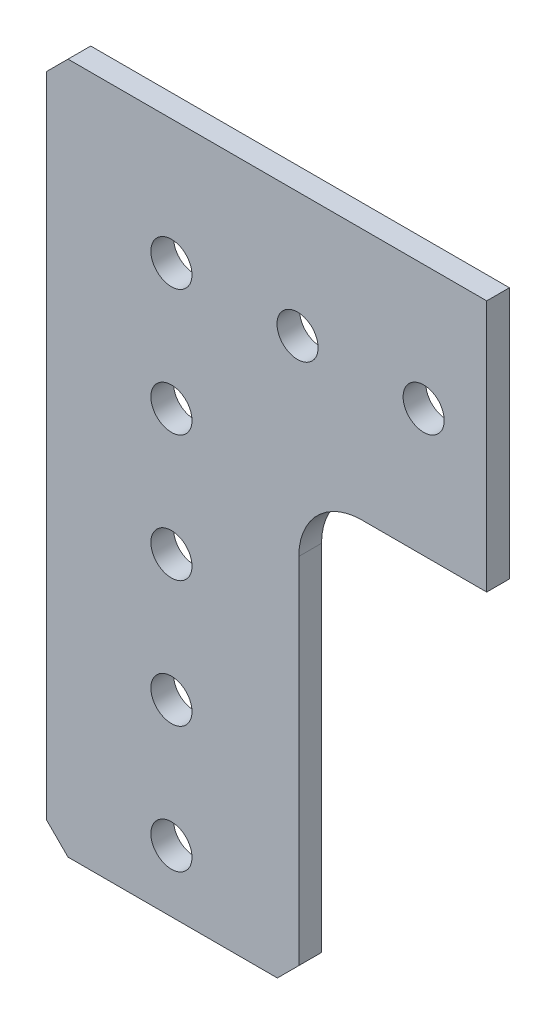
ISO-10303-21;
HEADER;
FILE_DESCRIPTION(('STEP AP214'),'2;1');
FILE_NAME('part.step','',(''),(''),'','','');
FILE_SCHEMA(('AUTOMOTIVE_DESIGN { 1 0 10303 214 1 1 1 1 }'));
ENDSEC;
DATA;
#1=APPLICATION_CONTEXT('core data for automotive mechanical design processes');
#2=APPLICATION_PROTOCOL_DEFINITION('international standard','automotive_design',2000,#1);
#3=PRODUCT_CONTEXT('',#1,'mechanical');
#4=PRODUCT('Part','Part','',(#3));
#5=PRODUCT_RELATED_PRODUCT_CATEGORY('part','',(#4));
#6=PRODUCT_DEFINITION_FORMATION('','',#4);
#7=PRODUCT_DEFINITION_CONTEXT('part definition',#1,'design');
#8=PRODUCT_DEFINITION('design','',#6,#7);
#9=PRODUCT_DEFINITION_SHAPE('','',#8);
#10=(LENGTH_UNIT() NAMED_UNIT(*) SI_UNIT(.MILLI.,.METRE.));
#11=(NAMED_UNIT(*) PLANE_ANGLE_UNIT() SI_UNIT($,.RADIAN.));
#12=(NAMED_UNIT(*) SI_UNIT($,.STERADIAN.) SOLID_ANGLE_UNIT());
#13=UNCERTAINTY_MEASURE_WITH_UNIT(LENGTH_MEASURE(1.E-05),#10,'distance_accuracy_value','');
#14=(GEOMETRIC_REPRESENTATION_CONTEXT(3) GLOBAL_UNCERTAINTY_ASSIGNED_CONTEXT((#13)) GLOBAL_UNIT_ASSIGNED_CONTEXT((#10,
#11,#12)) REPRESENTATION_CONTEXT('',''));
#15=CARTESIAN_POINT('',(0.,0.,0.));
#16=DIRECTION('',(0.,0.,1.));
#17=DIRECTION('',(1.,0.,0.));
#18=AXIS2_PLACEMENT_3D('',#15,#16,#17);
#19=CARTESIAN_POINT('',(-12.573,10.414,2.286));
#20=DIRECTION('',(-0.707106781186548,0.707106781186547,0.));
#21=DIRECTION('',(-0.707106781186547,-0.707106781186548,0.));
#22=AXIS2_PLACEMENT_3D('',#19,#20,#21);
#23=PLANE('',#22);
#24=DIRECTION('',(0.707106781186547,0.707106781186548,0.));
#25=VECTOR('',#24,1.);
#26=CARTESIAN_POINT('',(-12.573,10.414,0.));
#27=LINE('',#26,#25);
#28=CARTESIAN_POINT('',(-12.573,10.414,0.));
#29=VERTEX_POINT('',#28);
#30=CARTESIAN_POINT('',(-10.414,12.573,0.));
#31=VERTEX_POINT('',#30);
#32=EDGE_CURVE('E143',#29,#31,#27,.T.);
#33=ORIENTED_EDGE('',*,*,#32,.F.);
#34=DIRECTION('',(0.,0.,-1.));
#35=VECTOR('',#34,1.);
#36=CARTESIAN_POINT('',(-12.573,10.414,2.286));
#37=LINE('',#36,#35);
#38=CARTESIAN_POINT('',(-12.573,10.414,2.286));
#39=VERTEX_POINT('',#38);
#40=EDGE_CURVE('E11',#39,#29,#37,.T.);
#41=ORIENTED_EDGE('',*,*,#40,.F.);
#42=DIRECTION('',(0.707106781186547,0.707106781186548,0.));
#43=VECTOR('',#42,1.);
#44=CARTESIAN_POINT('',(-12.573,10.414,2.286));
#45=LINE('',#44,#43);
#46=CARTESIAN_POINT('',(-10.414,12.573,2.286));
#47=VERTEX_POINT('',#46);
#48=EDGE_CURVE('E166',#39,#47,#45,.T.);
#49=ORIENTED_EDGE('',*,*,#48,.T.);
#50=DIRECTION('',(0.,0.,-1.));
#51=VECTOR('',#50,1.);
#52=CARTESIAN_POINT('',(-10.414,12.573,2.286));
#53=LINE('',#52,#51);
#54=EDGE_CURVE('E35',#47,#31,#53,.T.);
#55=ORIENTED_EDGE('',*,*,#54,.T.);
#56=EDGE_LOOP('',(#33,#41,#49,#55));
#57=FACE_BOUND('',#56,.T.);
#58=ADVANCED_FACE('F32',(#57),#23,.T.);
#59=CARTESIAN_POINT('',(-12.573,-54.864,2.286));
#60=DIRECTION('',(-1.,0.,0.));
#61=DIRECTION('',(0.,-1.,0.));
#62=AXIS2_PLACEMENT_3D('',#59,#60,#61);
#63=PLANE('',#62);
#64=DIRECTION('',(0.,1.,0.));
#65=VECTOR('',#64,1.);
#66=CARTESIAN_POINT('',(-12.573,-54.864,0.));
#67=LINE('',#66,#65);
#68=CARTESIAN_POINT('',(-12.573,-54.864,0.));
#69=VERTEX_POINT('',#68);
#70=EDGE_CURVE('E164',#69,#29,#67,.T.);
#71=ORIENTED_EDGE('',*,*,#70,.F.);
#72=DIRECTION('',(0.,0.,-1.));
#73=VECTOR('',#72,1.);
#74=CARTESIAN_POINT('',(-12.573,-54.864,2.286));
#75=LINE('',#74,#73);
#76=CARTESIAN_POINT('',(-12.573,-54.864,2.286));
#77=VERTEX_POINT('',#76);
#78=EDGE_CURVE('E40',#77,#69,#75,.T.);
#79=ORIENTED_EDGE('',*,*,#78,.F.);
#80=DIRECTION('',(0.,1.,0.));
#81=VECTOR('',#80,1.);
#82=CARTESIAN_POINT('',(-12.573,-54.864,2.286));
#83=LINE('',#82,#81);
#84=EDGE_CURVE('E133',#77,#39,#83,.T.);
#85=ORIENTED_EDGE('',*,*,#84,.T.);
#86=ORIENTED_EDGE('',*,*,#40,.T.);
#87=EDGE_LOOP('',(#71,#79,#85,#86));
#88=FACE_BOUND('',#87,.T.);
#89=ADVANCED_FACE('F186',(#88),#63,.T.);
#90=CARTESIAN_POINT('',(-10.414,-57.023,2.286));
#91=DIRECTION('',(-0.707106781186544,-0.707106781186551,0.));
#92=DIRECTION('',(0.707106781186551,-0.707106781186544,0.));
#93=AXIS2_PLACEMENT_3D('',#90,#91,#92);
#94=PLANE('',#93);
#95=DIRECTION('',(-0.707106781186551,0.707106781186544,0.));
#96=VECTOR('',#95,1.);
#97=CARTESIAN_POINT('',(-10.414,-57.023,0.));
#98=LINE('',#97,#96);
#99=CARTESIAN_POINT('',(-10.414,-57.023,0.));
#100=VERTEX_POINT('',#99);
#101=EDGE_CURVE('E118',#100,#69,#98,.T.);
#102=ORIENTED_EDGE('',*,*,#101,.F.);
#103=DIRECTION('',(0.,0.,-1.));
#104=VECTOR('',#103,1.);
#105=CARTESIAN_POINT('',(-10.414,-57.023,2.286));
#106=LINE('',#105,#104);
#107=CARTESIAN_POINT('',(-10.414,-57.023,2.286));
#108=VERTEX_POINT('',#107);
#109=EDGE_CURVE('E112',#108,#100,#106,.T.);
#110=ORIENTED_EDGE('',*,*,#109,.F.);
#111=DIRECTION('',(-0.707106781186551,0.707106781186544,0.));
#112=VECTOR('',#111,1.);
#113=CARTESIAN_POINT('',(-10.414,-57.023,2.286));
#114=LINE('',#113,#112);
#115=EDGE_CURVE('E115',#108,#77,#114,.T.);
#116=ORIENTED_EDGE('',*,*,#115,.T.);
#117=ORIENTED_EDGE('',*,*,#78,.T.);
#118=EDGE_LOOP('',(#102,#110,#116,#117));
#119=FACE_BOUND('',#118,.T.);
#120=ADVANCED_FACE('F114',(#119),#94,.T.);
#121=CARTESIAN_POINT('',(10.668,-57.023,2.286));
#122=DIRECTION('',(0.,-1.,0.));
#123=DIRECTION('',(1.,0.,0.));
#124=AXIS2_PLACEMENT_3D('',#121,#122,#123);
#125=PLANE('',#124);
#126=DIRECTION('',(-1.,0.,0.));
#127=VECTOR('',#126,1.);
#128=CARTESIAN_POINT('',(10.668,-57.023,0.));
#129=LINE('',#128,#127);
#130=CARTESIAN_POINT('',(10.668,-57.023,0.));
#131=VERTEX_POINT('',#130);
#132=EDGE_CURVE('E161',#131,#100,#129,.T.);
#133=ORIENTED_EDGE('',*,*,#132,.F.);
#134=DIRECTION('',(0.,0.,-1.));
#135=VECTOR('',#134,1.);
#136=CARTESIAN_POINT('',(10.668,-57.023,2.286));
#137=LINE('',#136,#135);
#138=CARTESIAN_POINT('',(10.668,-57.023,2.286));
#139=VERTEX_POINT('',#138);
#140=EDGE_CURVE('E123',#139,#131,#137,.T.);
#141=ORIENTED_EDGE('',*,*,#140,.F.);
#142=DIRECTION('',(-1.,0.,0.));
#143=VECTOR('',#142,1.);
#144=CARTESIAN_POINT('',(10.668,-57.023,2.286));
#145=LINE('',#144,#143);
#146=EDGE_CURVE('E131',#139,#108,#145,.T.);
#147=ORIENTED_EDGE('',*,*,#146,.T.);
#148=ORIENTED_EDGE('',*,*,#109,.T.);
#149=EDGE_LOOP('',(#133,#141,#147,#148));
#150=FACE_BOUND('',#149,.T.);
#151=ADVANCED_FACE('F135',(#150),#125,.T.);
#152=CARTESIAN_POINT('',(12.827,-54.864,2.286));
#153=DIRECTION('',(0.707106781186548,-0.707106781186547,0.));
#154=DIRECTION('',(0.707106781186547,0.707106781186548,0.));
#155=AXIS2_PLACEMENT_3D('',#152,#153,#154);
#156=PLANE('',#155);
#157=DIRECTION('',(-0.707106781186547,-0.707106781186548,0.));
#158=VECTOR('',#157,1.);
#159=CARTESIAN_POINT('',(12.827,-54.864,0.));
#160=LINE('',#159,#158);
#161=CARTESIAN_POINT('',(12.827,-54.864,0.));
#162=VERTEX_POINT('',#161);
#163=EDGE_CURVE('E158',#162,#131,#160,.T.);
#164=ORIENTED_EDGE('',*,*,#163,.F.);
#165=DIRECTION('',(0.,0.,-1.));
#166=VECTOR('',#165,1.);
#167=CARTESIAN_POINT('',(12.827,-54.864,2.286));
#168=LINE('',#167,#166);
#169=CARTESIAN_POINT('',(12.827,-54.864,2.286));
#170=VERTEX_POINT('',#169);
#171=EDGE_CURVE('E170',#170,#162,#168,.T.);
#172=ORIENTED_EDGE('',*,*,#171,.F.);
#173=DIRECTION('',(-0.707106781186547,-0.707106781186548,0.));
#174=VECTOR('',#173,1.);
#175=CARTESIAN_POINT('',(12.827,-54.864,2.286));
#176=LINE('',#175,#174);
#177=EDGE_CURVE('E136',#170,#139,#176,.T.);
#178=ORIENTED_EDGE('',*,*,#177,.T.);
#179=ORIENTED_EDGE('',*,*,#140,.T.);
#180=EDGE_LOOP('',(#164,#172,#178,#179));
#181=FACE_BOUND('',#180,.T.);
#182=ADVANCED_FACE('F199',(#181),#156,.T.);
#183=CARTESIAN_POINT('',(12.827,-19.177,2.286));
#184=DIRECTION('',(1.,0.,0.));
#185=DIRECTION('',(0.,0.,-1.));
#186=AXIS2_PLACEMENT_3D('',#183,#184,#185);
#187=PLANE('',#186);
#188=DIRECTION('',(0.,-1.,0.));
#189=VECTOR('',#188,1.);
#190=CARTESIAN_POINT('',(12.827,-19.177,0.));
#191=LINE('',#190,#189);
#192=CARTESIAN_POINT('',(12.827,-19.177,0.));
#193=VERTEX_POINT('',#192);
#194=EDGE_CURVE('E155',#193,#162,#191,.T.);
#195=ORIENTED_EDGE('',*,*,#194,.F.);
#196=DIRECTION('',(0.,0.,-1.));
#197=VECTOR('',#196,1.);
#198=CARTESIAN_POINT('',(12.827,-19.177,2.286));
#199=LINE('',#198,#197);
#200=CARTESIAN_POINT('',(12.827,-19.177,2.286));
#201=VERTEX_POINT('',#200);
#202=EDGE_CURVE('E172',#201,#193,#199,.T.);
#203=ORIENTED_EDGE('',*,*,#202,.F.);
#204=DIRECTION('',(0.,-1.,0.));
#205=VECTOR('',#204,1.);
#206=CARTESIAN_POINT('',(12.827,-19.177,2.286));
#207=LINE('',#206,#205);
#208=EDGE_CURVE('E138',#201,#170,#207,.T.);
#209=ORIENTED_EDGE('',*,*,#208,.T.);
#210=ORIENTED_EDGE('',*,*,#171,.T.);
#211=EDGE_LOOP('',(#195,#203,#209,#210));
#212=FACE_BOUND('',#211,.T.);
#213=ADVANCED_FACE('F202',(#212),#187,.T.);
#214=CARTESIAN_POINT('',(19.177,-19.177,2.286));
#215=DIRECTION('',(0.,0.,-1.));
#216=DIRECTION('',(-1.,0.,0.));
#217=AXIS2_PLACEMENT_3D('',#214,#215,#216);
#218=CYLINDRICAL_SURFACE('',#217,6.35);
#219=CARTESIAN_POINT('',(19.177,-19.177,0.));
#220=DIRECTION('',(0.,0.,1.));
#221=DIRECTION('',(1.,0.,0.));
#222=AXIS2_PLACEMENT_3D('',#219,#220,#221);
#223=CIRCLE('',#222,6.35);
#224=CARTESIAN_POINT('',(19.177,-12.827,0.));
#225=VERTEX_POINT('',#224);
#226=EDGE_CURVE('E152',#225,#193,#223,.T.);
#227=ORIENTED_EDGE('',*,*,#226,.F.);
#228=DIRECTION('',(0.,0.,-1.));
#229=VECTOR('',#228,1.);
#230=CARTESIAN_POINT('',(19.177,-12.827,2.286));
#231=LINE('',#230,#229);
#232=CARTESIAN_POINT('',(19.177,-12.827,2.286));
#233=VERTEX_POINT('',#232);
#234=EDGE_CURVE('E173',#233,#225,#231,.T.);
#235=ORIENTED_EDGE('',*,*,#234,.F.);
#236=CARTESIAN_POINT('',(19.177,-19.177,2.286));
#237=DIRECTION('',(0.,0.,1.));
#238=DIRECTION('',(1.,0.,0.));
#239=AXIS2_PLACEMENT_3D('',#236,#237,#238);
#240=CIRCLE('',#239,6.35);
#241=EDGE_CURVE('E264',#233,#201,#240,.T.);
#242=ORIENTED_EDGE('',*,*,#241,.T.);
#243=ORIENTED_EDGE('',*,*,#202,.T.);
#244=EDGE_LOOP('',(#227,#235,#242,#243));
#245=FACE_BOUND('',#244,.T.);
#246=ADVANCED_FACE('F206',(#245),#218,.F.);
#247=CARTESIAN_POINT('',(54.864,-12.827,2.286));
#248=DIRECTION('',(0.,-1.,0.));
#249=DIRECTION('',(0.,0.,-1.));
#250=AXIS2_PLACEMENT_3D('',#247,#248,#249);
#251=PLANE('',#250);
#252=DIRECTION('',(0.,0.,1.));
#253=VECTOR('',#252,1.);
#254=CARTESIAN_POINT('',(31.75,-12.827,0.));
#255=LINE('',#254,#253);
#256=CARTESIAN_POINT('',(31.75,-12.827,0.));
#257=VERTEX_POINT('',#256);
#258=CARTESIAN_POINT('',(31.75,-12.827,2.286));
#259=VERTEX_POINT('',#258);
#260=EDGE_CURVE('E48',#257,#259,#255,.T.);
#261=ORIENTED_EDGE('',*,*,#260,.T.);
#262=DIRECTION('',(-1.,0.,0.));
#263=VECTOR('',#262,1.);
#264=CARTESIAN_POINT('',(54.864,-12.827,2.286));
#265=LINE('',#264,#263);
#266=EDGE_CURVE('E259',#259,#233,#265,.T.);
#267=ORIENTED_EDGE('',*,*,#266,.T.);
#268=ORIENTED_EDGE('',*,*,#234,.T.);
#269=DIRECTION('',(-1.,0.,0.));
#270=VECTOR('',#269,1.);
#271=CARTESIAN_POINT('',(54.864,-12.827,0.));
#272=LINE('',#271,#270);
#273=EDGE_CURVE('E150',#257,#225,#272,.T.);
#274=ORIENTED_EDGE('',*,*,#273,.F.);
#275=EDGE_LOOP('',(#261,#267,#268,#274));
#276=FACE_BOUND('',#275,.T.);
#277=ADVANCED_FACE('F210',(#276),#251,.T.);
#278=CARTESIAN_POINT('',(-10.414,12.573,2.286));
#279=DIRECTION('',(0.,1.,0.));
#280=DIRECTION('',(-1.,0.,0.));
#281=AXIS2_PLACEMENT_3D('',#278,#279,#280);
#282=PLANE('',#281);
#283=DIRECTION('',(0.,0.,1.));
#284=VECTOR('',#283,1.);
#285=CARTESIAN_POINT('',(31.75,12.573,0.));
#286=LINE('',#285,#284);
#287=CARTESIAN_POINT('',(31.75,12.573,0.));
#288=VERTEX_POINT('',#287);
#289=CARTESIAN_POINT('',(31.75,12.573,2.286));
#290=VERTEX_POINT('',#289);
#291=EDGE_CURVE('E183',#288,#290,#286,.T.);
#292=ORIENTED_EDGE('',*,*,#291,.F.);
#293=DIRECTION('',(1.,0.,0.));
#294=VECTOR('',#293,1.);
#295=CARTESIAN_POINT('',(-10.414,12.573,0.));
#296=LINE('',#295,#294);
#297=EDGE_CURVE('E146',#31,#288,#296,.T.);
#298=ORIENTED_EDGE('',*,*,#297,.F.);
#299=ORIENTED_EDGE('',*,*,#54,.F.);
#300=DIRECTION('',(1.,0.,0.));
#301=VECTOR('',#300,1.);
#302=CARTESIAN_POINT('',(-10.414,12.573,2.286));
#303=LINE('',#302,#301);
#304=EDGE_CURVE('E265',#47,#290,#303,.T.);
#305=ORIENTED_EDGE('',*,*,#304,.T.);
#306=EDGE_LOOP('',(#292,#298,#299,#305));
#307=FACE_BOUND('',#306,.T.);
#308=ADVANCED_FACE('F180',(#307),#282,.T.);
#309=CARTESIAN_POINT('',(19.177,-19.177,2.286));
#310=DIRECTION('',(0.,0.,1.));
#311=DIRECTION('',(1.,0.,0.));
#312=AXIS2_PLACEMENT_3D('',#309,#310,#311);
#313=PLANE('',#312);
#314=DIRECTION('',(0.,-1.,0.));
#315=VECTOR('',#314,1.);
#316=CARTESIAN_POINT('',(31.75,-19.177,2.286));
#317=LINE('',#316,#315);
#318=EDGE_CURVE('E254',#290,#259,#317,.T.);
#319=ORIENTED_EDGE('',*,*,#318,.F.);
#320=ORIENTED_EDGE('',*,*,#304,.F.);
#321=ORIENTED_EDGE('',*,*,#48,.F.);
#322=ORIENTED_EDGE('',*,*,#84,.F.);
#323=ORIENTED_EDGE('',*,*,#115,.F.);
#324=ORIENTED_EDGE('',*,*,#146,.F.);
#325=ORIENTED_EDGE('',*,*,#177,.F.);
#326=ORIENTED_EDGE('',*,*,#208,.F.);
#327=ORIENTED_EDGE('',*,*,#241,.F.);
#328=ORIENTED_EDGE('',*,*,#266,.F.);
#329=EDGE_LOOP('',(#319,#320,#321,#322,#323,#324,#325,#326,#327,#328));
#330=FACE_BOUND('',#329,.T.);
#331=CARTESIAN_POINT('',(3.9907631702977E-13,-38.1,2.286));
#332=DIRECTION('',(0.,0.,-1.));
#333=DIRECTION('',(1.,0.,0.));
#334=AXIS2_PLACEMENT_3D('',#331,#332,#333);
#335=CIRCLE('',#334,2.0701);
#336=CARTESIAN_POINT('',(2.0701000000004,-38.1,2.286));
#337=VERTEX_POINT('',#336);
#338=EDGE_CURVE('E277',#337,#337,#335,.T.);
#339=ORIENTED_EDGE('',*,*,#338,.T.);
#340=EDGE_LOOP('',(#339));
#341=FACE_BOUND('',#340,.T.);
#342=CARTESIAN_POINT('',(1.33025439009923E-13,-12.7,2.286));
#343=DIRECTION('',(0.,0.,-1.));
#344=DIRECTION('',(1.,0.,0.));
#345=AXIS2_PLACEMENT_3D('',#342,#343,#344);
#346=CIRCLE('',#345,2.0701);
#347=CARTESIAN_POINT('',(2.07010000000013,-12.7,2.286));
#348=VERTEX_POINT('',#347);
#349=EDGE_CURVE('E283',#348,#348,#346,.T.);
#350=ORIENTED_EDGE('',*,*,#349,.T.);
#351=EDGE_LOOP('',(#350));
#352=FACE_BOUND('',#351,.T.);
#353=CARTESIAN_POINT('',(25.4,3.54734504026462E-13,2.286));
#354=DIRECTION('',(0.,0.,-1.));
#355=DIRECTION('',(1.,0.,0.));
#356=AXIS2_PLACEMENT_3D('',#353,#354,#355);
#357=CIRCLE('',#356,2.0701);
#358=CARTESIAN_POINT('',(27.4701,3.54734504026462E-13,2.286));
#359=VERTEX_POINT('',#358);
#360=EDGE_CURVE('E289',#359,#359,#357,.T.);
#361=ORIENTED_EDGE('',*,*,#360,.T.);
#362=EDGE_LOOP('',(#361));
#363=FACE_BOUND('',#362,.T.);
#364=CARTESIAN_POINT('',(0.,0.,2.286));
#365=DIRECTION('',(0.,0.,-1.));
#366=DIRECTION('',(1.,0.,0.));
#367=AXIS2_PLACEMENT_3D('',#364,#365,#366);
#368=CIRCLE('',#367,2.0701);
#369=CARTESIAN_POINT('',(2.0701,0.,2.286));
#370=VERTEX_POINT('',#369);
#371=EDGE_CURVE('E295',#370,#370,#368,.T.);
#372=ORIENTED_EDGE('',*,*,#371,.T.);
#373=EDGE_LOOP('',(#372));
#374=FACE_BOUND('',#373,.T.);
#375=CARTESIAN_POINT('',(12.7,1.77367252013231E-13,2.286));
#376=DIRECTION('',(0.,0.,-1.));
#377=DIRECTION('',(1.,0.,0.));
#378=AXIS2_PLACEMENT_3D('',#375,#376,#377);
#379=CIRCLE('',#378,2.0701);
#380=CARTESIAN_POINT('',(14.7701,1.77367252013231E-13,2.286));
#381=VERTEX_POINT('',#380);
#382=EDGE_CURVE('E301',#381,#381,#379,.T.);
#383=ORIENTED_EDGE('',*,*,#382,.T.);
#384=EDGE_LOOP('',(#383));
#385=FACE_BOUND('',#384,.T.);
#386=CARTESIAN_POINT('',(2.66050878019847E-13,-25.4,2.286));
#387=DIRECTION('',(0.,0.,-1.));
#388=DIRECTION('',(1.,0.,0.));
#389=AXIS2_PLACEMENT_3D('',#386,#387,#388);
#390=CIRCLE('',#389,2.0701);
#391=CARTESIAN_POINT('',(2.07010000000027,-25.4,2.286));
#392=VERTEX_POINT('',#391);
#393=EDGE_CURVE('E307',#392,#392,#390,.T.);
#394=ORIENTED_EDGE('',*,*,#393,.T.);
#395=EDGE_LOOP('',(#394));
#396=FACE_BOUND('',#395,.T.);
#397=CARTESIAN_POINT('',(0.,-50.8,2.286));
#398=DIRECTION('',(0.,0.,-1.));
#399=DIRECTION('',(1.,0.,0.));
#400=AXIS2_PLACEMENT_3D('',#397,#398,#399);
#401=CIRCLE('',#400,2.0701);
#402=CARTESIAN_POINT('',(2.07010000000001,-50.8,2.286));
#403=VERTEX_POINT('',#402);
#404=EDGE_CURVE('E147',#403,#403,#401,.T.);
#405=ORIENTED_EDGE('',*,*,#404,.T.);
#406=EDGE_LOOP('',(#405));
#407=FACE_BOUND('',#406,.T.);
#408=ADVANCED_FACE('F128',(#330,#341,#352,#363,#374,#385,#396,#407),#313,.T.);
#409=CARTESIAN_POINT('',(19.177,-19.177,0.));
#410=DIRECTION('',(0.,0.,1.));
#411=DIRECTION('',(1.,0.,0.));
#412=AXIS2_PLACEMENT_3D('',#409,#410,#411);
#413=PLANE('',#412);
#414=CARTESIAN_POINT('',(3.9907631702977E-13,-38.1,0.));
#415=DIRECTION('',(0.,0.,-1.));
#416=DIRECTION('',(1.,0.,0.));
#417=AXIS2_PLACEMENT_3D('',#414,#415,#416);
#418=CIRCLE('',#417,2.0701);
#419=CARTESIAN_POINT('',(2.0701000000004,-38.1,0.));
#420=VERTEX_POINT('',#419);
#421=EDGE_CURVE('E257',#420,#420,#418,.T.);
#422=ORIENTED_EDGE('',*,*,#421,.F.);
#423=EDGE_LOOP('',(#422));
#424=FACE_BOUND('',#423,.T.);
#425=CARTESIAN_POINT('',(1.33025439009923E-13,-12.7,0.));
#426=DIRECTION('',(0.,0.,-1.));
#427=DIRECTION('',(1.,0.,0.));
#428=AXIS2_PLACEMENT_3D('',#425,#426,#427);
#429=CIRCLE('',#428,2.0701);
#430=CARTESIAN_POINT('',(2.07010000000013,-12.7,0.));
#431=VERTEX_POINT('',#430);
#432=EDGE_CURVE('E280',#431,#431,#429,.T.);
#433=ORIENTED_EDGE('',*,*,#432,.F.);
#434=EDGE_LOOP('',(#433));
#435=FACE_BOUND('',#434,.T.);
#436=CARTESIAN_POINT('',(25.4,3.54734504026462E-13,0.));
#437=DIRECTION('',(0.,0.,-1.));
#438=DIRECTION('',(1.,0.,0.));
#439=AXIS2_PLACEMENT_3D('',#436,#437,#438);
#440=CIRCLE('',#439,2.0701);
#441=CARTESIAN_POINT('',(27.4701,3.54734504026462E-13,0.));
#442=VERTEX_POINT('',#441);
#443=EDGE_CURVE('E286',#442,#442,#440,.T.);
#444=ORIENTED_EDGE('',*,*,#443,.F.);
#445=EDGE_LOOP('',(#444));
#446=FACE_BOUND('',#445,.T.);
#447=CARTESIAN_POINT('',(0.,0.,0.));
#448=DIRECTION('',(0.,0.,-1.));
#449=DIRECTION('',(1.,0.,0.));
#450=AXIS2_PLACEMENT_3D('',#447,#448,#449);
#451=CIRCLE('',#450,2.0701);
#452=CARTESIAN_POINT('',(2.0701,0.,0.));
#453=VERTEX_POINT('',#452);
#454=EDGE_CURVE('E292',#453,#453,#451,.T.);
#455=ORIENTED_EDGE('',*,*,#454,.F.);
#456=EDGE_LOOP('',(#455));
#457=FACE_BOUND('',#456,.T.);
#458=CARTESIAN_POINT('',(12.7,1.77367252013231E-13,0.));
#459=DIRECTION('',(0.,0.,-1.));
#460=DIRECTION('',(1.,0.,0.));
#461=AXIS2_PLACEMENT_3D('',#458,#459,#460);
#462=CIRCLE('',#461,2.0701);
#463=CARTESIAN_POINT('',(14.7701,1.77367252013231E-13,0.));
#464=VERTEX_POINT('',#463);
#465=EDGE_CURVE('E298',#464,#464,#462,.T.);
#466=ORIENTED_EDGE('',*,*,#465,.F.);
#467=EDGE_LOOP('',(#466));
#468=FACE_BOUND('',#467,.T.);
#469=CARTESIAN_POINT('',(2.66050878019847E-13,-25.4,0.));
#470=DIRECTION('',(0.,0.,-1.));
#471=DIRECTION('',(1.,0.,0.));
#472=AXIS2_PLACEMENT_3D('',#469,#470,#471);
#473=CIRCLE('',#472,2.0701);
#474=CARTESIAN_POINT('',(2.07010000000027,-25.4,0.));
#475=VERTEX_POINT('',#474);
#476=EDGE_CURVE('E304',#475,#475,#473,.T.);
#477=ORIENTED_EDGE('',*,*,#476,.F.);
#478=EDGE_LOOP('',(#477));
#479=FACE_BOUND('',#478,.T.);
#480=CARTESIAN_POINT('',(0.,-50.8,0.));
#481=DIRECTION('',(0.,0.,-1.));
#482=DIRECTION('',(1.,0.,0.));
#483=AXIS2_PLACEMENT_3D('',#480,#481,#482);
#484=CIRCLE('',#483,2.0701);
#485=CARTESIAN_POINT('',(2.07010000000001,-50.8,0.));
#486=VERTEX_POINT('',#485);
#487=EDGE_CURVE('E310',#486,#486,#484,.T.);
#488=ORIENTED_EDGE('',*,*,#487,.F.);
#489=EDGE_LOOP('',(#488));
#490=FACE_BOUND('',#489,.T.);
#491=ORIENTED_EDGE('',*,*,#297,.T.);
#492=DIRECTION('',(0.,-1.,0.));
#493=VECTOR('',#492,1.);
#494=CARTESIAN_POINT('',(31.75,-12.827,0.));
#495=LINE('',#494,#493);
#496=EDGE_CURVE('E273',#288,#257,#495,.T.);
#497=ORIENTED_EDGE('',*,*,#496,.T.);
#498=ORIENTED_EDGE('',*,*,#273,.T.);
#499=ORIENTED_EDGE('',*,*,#226,.T.);
#500=ORIENTED_EDGE('',*,*,#194,.T.);
#501=ORIENTED_EDGE('',*,*,#163,.T.);
#502=ORIENTED_EDGE('',*,*,#132,.T.);
#503=ORIENTED_EDGE('',*,*,#101,.T.);
#504=ORIENTED_EDGE('',*,*,#70,.T.);
#505=ORIENTED_EDGE('',*,*,#32,.T.);
#506=EDGE_LOOP('',(#491,#497,#498,#499,#500,#501,#502,#503,#504,#505));
#507=FACE_BOUND('',#506,.T.);
#508=ADVANCED_FACE('F185',(#424,#435,#446,#457,#468,#479,#490,#507),#413,.F.);
#509=CARTESIAN_POINT('',(0.,-50.8,2.286));
#510=DIRECTION('',(0.,0.,-1.));
#511=DIRECTION('',(-1.,0.,0.));
#512=AXIS2_PLACEMENT_3D('',#509,#510,#511);
#513=CYLINDRICAL_SURFACE('',#512,2.0701);
#514=ORIENTED_EDGE('',*,*,#404,.F.);
#515=EDGE_LOOP('',(#514));
#516=FACE_BOUND('',#515,.T.);
#517=ORIENTED_EDGE('',*,*,#487,.T.);
#518=EDGE_LOOP('',(#517));
#519=FACE_BOUND('',#518,.T.);
#520=ADVANCED_FACE('F220',(#516,#519),#513,.F.);
#521=CARTESIAN_POINT('',(2.66050878019847E-13,-25.4,2.286));
#522=DIRECTION('',(0.,0.,-1.));
#523=DIRECTION('',(-1.,0.,0.));
#524=AXIS2_PLACEMENT_3D('',#521,#522,#523);
#525=CYLINDRICAL_SURFACE('',#524,2.0701);
#526=ORIENTED_EDGE('',*,*,#393,.F.);
#527=EDGE_LOOP('',(#526));
#528=FACE_BOUND('',#527,.T.);
#529=ORIENTED_EDGE('',*,*,#476,.T.);
#530=EDGE_LOOP('',(#529));
#531=FACE_BOUND('',#530,.T.);
#532=ADVANCED_FACE('F225',(#528,#531),#525,.F.);
#533=CARTESIAN_POINT('',(12.7,1.77367252013231E-13,2.286));
#534=DIRECTION('',(0.,0.,-1.));
#535=DIRECTION('',(-1.,0.,0.));
#536=AXIS2_PLACEMENT_3D('',#533,#534,#535);
#537=CYLINDRICAL_SURFACE('',#536,2.0701);
#538=ORIENTED_EDGE('',*,*,#382,.F.);
#539=EDGE_LOOP('',(#538));
#540=FACE_BOUND('',#539,.T.);
#541=ORIENTED_EDGE('',*,*,#465,.T.);
#542=EDGE_LOOP('',(#541));
#543=FACE_BOUND('',#542,.T.);
#544=ADVANCED_FACE('F229',(#540,#543),#537,.F.);
#545=CARTESIAN_POINT('',(0.,0.,2.286));
#546=DIRECTION('',(0.,0.,-1.));
#547=DIRECTION('',(-1.,0.,0.));
#548=AXIS2_PLACEMENT_3D('',#545,#546,#547);
#549=CYLINDRICAL_SURFACE('',#548,2.0701);
#550=ORIENTED_EDGE('',*,*,#371,.F.);
#551=EDGE_LOOP('',(#550));
#552=FACE_BOUND('',#551,.T.);
#553=ORIENTED_EDGE('',*,*,#454,.T.);
#554=EDGE_LOOP('',(#553));
#555=FACE_BOUND('',#554,.T.);
#556=ADVANCED_FACE('F233',(#552,#555),#549,.F.);
#557=CARTESIAN_POINT('',(25.4,3.54734504026462E-13,2.286));
#558=DIRECTION('',(0.,0.,-1.));
#559=DIRECTION('',(-1.,0.,0.));
#560=AXIS2_PLACEMENT_3D('',#557,#558,#559);
#561=CYLINDRICAL_SURFACE('',#560,2.0701);
#562=ORIENTED_EDGE('',*,*,#360,.F.);
#563=EDGE_LOOP('',(#562));
#564=FACE_BOUND('',#563,.T.);
#565=ORIENTED_EDGE('',*,*,#443,.T.);
#566=EDGE_LOOP('',(#565));
#567=FACE_BOUND('',#566,.T.);
#568=ADVANCED_FACE('F237',(#564,#567),#561,.F.);
#569=CARTESIAN_POINT('',(1.33025439009923E-13,-12.7,2.286));
#570=DIRECTION('',(0.,0.,-1.));
#571=DIRECTION('',(-1.,0.,0.));
#572=AXIS2_PLACEMENT_3D('',#569,#570,#571);
#573=CYLINDRICAL_SURFACE('',#572,2.0701);
#574=ORIENTED_EDGE('',*,*,#349,.F.);
#575=EDGE_LOOP('',(#574));
#576=FACE_BOUND('',#575,.T.);
#577=ORIENTED_EDGE('',*,*,#432,.T.);
#578=EDGE_LOOP('',(#577));
#579=FACE_BOUND('',#578,.T.);
#580=ADVANCED_FACE('F241',(#576,#579),#573,.F.);
#581=CARTESIAN_POINT('',(3.9907631702977E-13,-38.1,2.286));
#582=DIRECTION('',(0.,0.,-1.));
#583=DIRECTION('',(-1.,0.,0.));
#584=AXIS2_PLACEMENT_3D('',#581,#582,#583);
#585=CYLINDRICAL_SURFACE('',#584,2.0701);
#586=ORIENTED_EDGE('',*,*,#338,.F.);
#587=EDGE_LOOP('',(#586));
#588=FACE_BOUND('',#587,.T.);
#589=ORIENTED_EDGE('',*,*,#421,.T.);
#590=EDGE_LOOP('',(#589));
#591=FACE_BOUND('',#590,.T.);
#592=ADVANCED_FACE('F245',(#588,#591),#585,.F.);
#593=CARTESIAN_POINT('',(31.75,-12.827,0.));
#594=DIRECTION('',(-1.,0.,0.));
#595=DIRECTION('',(0.,0.,1.));
#596=AXIS2_PLACEMENT_3D('',#593,#594,#595);
#597=PLANE('',#596);
#598=ORIENTED_EDGE('',*,*,#318,.T.);
#599=ORIENTED_EDGE('',*,*,#260,.F.);
#600=ORIENTED_EDGE('',*,*,#496,.F.);
#601=ORIENTED_EDGE('',*,*,#291,.T.);
#602=EDGE_LOOP('',(#598,#599,#600,#601));
#603=FACE_BOUND('',#602,.T.);
#604=ADVANCED_FACE('F249',(#603),#597,.F.);
#605=CLOSED_SHELL('',(#58,#89,#120,#151,#182,#213,#246,#277,#308,#408,#508,#520,#532,#544,#556,
#568,#580,#592,#604));
#606=MANIFOLD_SOLID_BREP('B2',#605);
#607=ADVANCED_BREP_SHAPE_REPRESENTATION('',(#18,#606),#14);
#608=SHAPE_DEFINITION_REPRESENTATION(#9,#607);
ENDSEC;
END-ISO-10303-21;
